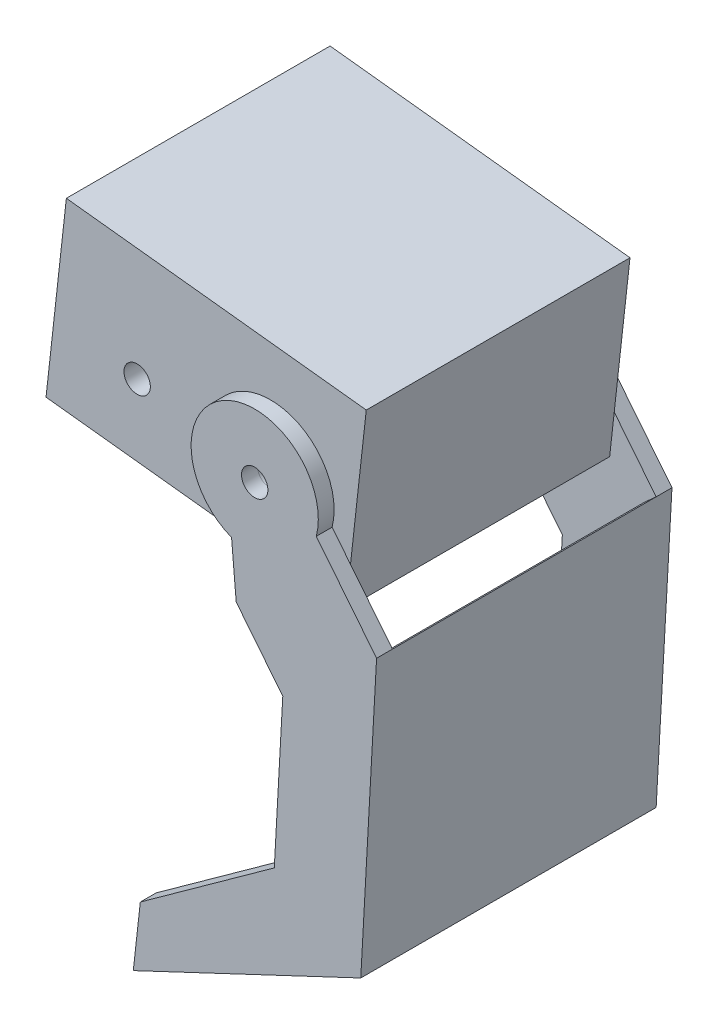
ISO-10303-21;
HEADER;
FILE_DESCRIPTION(('STEP AP214'),'2;1');
FILE_NAME('part.step','',(''),(''),'','','');
FILE_SCHEMA(('AUTOMOTIVE_DESIGN { 1 0 10303 214 1 1 1 1 }'));
ENDSEC;
DATA;
#1=APPLICATION_CONTEXT('core data for automotive mechanical design processes');
#2=APPLICATION_PROTOCOL_DEFINITION('international standard','automotive_design',2000,#1);
#3=PRODUCT_CONTEXT('',#1,'mechanical');
#4=PRODUCT('Part','Part','',(#3));
#5=PRODUCT_RELATED_PRODUCT_CATEGORY('part','',(#4));
#6=PRODUCT_DEFINITION_FORMATION('','',#4);
#7=PRODUCT_DEFINITION_CONTEXT('part definition',#1,'design');
#8=PRODUCT_DEFINITION('design','',#6,#7);
#9=PRODUCT_DEFINITION_SHAPE('','',#8);
#10=(LENGTH_UNIT() NAMED_UNIT(*) SI_UNIT(.MILLI.,.METRE.));
#11=(NAMED_UNIT(*) PLANE_ANGLE_UNIT() SI_UNIT($,.RADIAN.));
#12=(NAMED_UNIT(*) SI_UNIT($,.STERADIAN.) SOLID_ANGLE_UNIT());
#13=UNCERTAINTY_MEASURE_WITH_UNIT(LENGTH_MEASURE(1.E-05),#10,'distance_accuracy_value','');
#14=(GEOMETRIC_REPRESENTATION_CONTEXT(3) GLOBAL_UNCERTAINTY_ASSIGNED_CONTEXT((#13)) GLOBAL_UNIT_ASSIGNED_CONTEXT((#10,
#11,#12)) REPRESENTATION_CONTEXT('',''));
#15=CARTESIAN_POINT('',(0.,0.,0.));
#16=DIRECTION('',(0.,0.,1.));
#17=DIRECTION('',(1.,0.,0.));
#18=AXIS2_PLACEMENT_3D('',#15,#16,#17);
#19=CARTESIAN_POINT('',(-60.7140923076923,16.1163384615385,25.));
#20=DIRECTION('',(0.,0.,1.));
#21=DIRECTION('',(-0.993846153846154,0.110769230769231,0.));
#22=AXIS2_PLACEMENT_3D('',#19,#20,#21);
#23=PLANE('',#22);
#24=CARTESIAN_POINT('',(-60.7140923076923,16.1163384615385,25.));
#25=DIRECTION('',(0.,0.,-1.));
#26=DIRECTION('',(-0.993846153846154,0.110769230769231,0.));
#27=AXIS2_PLACEMENT_3D('',#24,#25,#26);
#28=CIRCLE('',#27,2.5);
#29=CARTESIAN_POINT('',(-63.1987076923077,16.3932615384615,25.));
#30=VERTEX_POINT('',#29);
#31=EDGE_CURVE('E282',#30,#30,#28,.T.);
#32=ORIENTED_EDGE('',*,*,#31,.F.);
#33=EDGE_LOOP('',(#32));
#34=FACE_BOUND('',#33,.T.);
#35=DIRECTION('',(0.110769230769231,0.993846153846154,0.));
#36=VECTOR('',#35,1.);
#37=CARTESIAN_POINT('',(-82.4001230769231,-63.6222153846154,25.));
#38=LINE('',#37,#36);
#39=CARTESIAN_POINT('',(-83.4691926581584,-73.214145238477,25.));
#40=VERTEX_POINT('',#39);
#41=CARTESIAN_POINT('',(-82.4001230769231,-63.6222153846154,25.));
#42=VERTEX_POINT('',#41);
#43=EDGE_CURVE('E187',#40,#42,#38,.T.);
#44=ORIENTED_EDGE('',*,*,#43,.T.);
#45=DIRECTION('',(0.811359006094352,0.584548170153313,0.));
#46=VECTOR('',#45,1.);
#47=CARTESIAN_POINT('',(-57.0007264957265,-45.3230769230769,25.));
#48=LINE('',#47,#46);
#49=CARTESIAN_POINT('',(-57.0007264957265,-45.3230769230769,25.));
#50=VERTEX_POINT('',#49);
#51=EDGE_CURVE('E321',#42,#50,#48,.T.);
#52=ORIENTED_EDGE('',*,*,#51,.T.);
#53=DIRECTION('',(0.0554700196225232,0.998460353205412,0.));
#54=VECTOR('',#53,1.);
#55=CARTESIAN_POINT('',(-55.3896153846154,-16.3230769230769,25.));
#56=LINE('',#55,#54);
#57=CARTESIAN_POINT('',(-55.3896153846154,-16.3230769230769,25.));
#58=VERTEX_POINT('',#57);
#59=EDGE_CURVE('E324',#50,#58,#56,.T.);
#60=ORIENTED_EDGE('',*,*,#59,.T.);
#61=DIRECTION('',(-0.624429680617044,0.781081029064525,0.));
#62=VECTOR('',#61,1.);
#63=CARTESIAN_POINT('',(-64.2203846153846,-5.27692307692307,25.));
#64=LINE('',#63,#62);
#65=CARTESIAN_POINT('',(-64.2203846153846,-5.27692307692307,25.));
#66=VERTEX_POINT('',#65);
#67=EDGE_CURVE('E327',#58,#66,#64,.T.);
#68=ORIENTED_EDGE('',*,*,#67,.T.);
#69=DIRECTION('',(-0.0862910994608008,0.996269966501975,0.));
#70=VECTOR('',#69,1.);
#71=CARTESIAN_POINT('',(-65.1003846153846,4.88307692307692,25.));
#72=LINE('',#71,#70);
#73=CARTESIAN_POINT('',(-65.1003846153846,4.88307692307692,25.));
#74=VERTEX_POINT('',#73);
#75=EDGE_CURVE('E330',#66,#74,#72,.T.);
#76=ORIENTED_EDGE('',*,*,#75,.T.);
#77=CARTESIAN_POINT('',(-60.7140923076923,16.1163384615385,25.));
#78=DIRECTION('',(0.,0.,-1.));
#79=DIRECTION('',(-0.993846153846154,0.110769230769231,0.));
#80=AXIS2_PLACEMENT_3D('',#77,#78,#79);
#81=CIRCLE('',#80,12.0592588909933);
#82=CARTESIAN_POINT('',(-49.037883863256,13.101063787139,25.));
#83=VERTEX_POINT('',#82);
#84=EDGE_CURVE('E293',#74,#83,#81,.T.);
#85=ORIENTED_EDGE('',*,*,#84,.T.);
#86=DIRECTION('',(0.624429680617043,-0.781081029064525,0.));
#87=VECTOR('',#86,1.);
#88=CARTESIAN_POINT('',(-37.605,-1.2,25.));
#89=LINE('',#88,#87);
#90=CARTESIAN_POINT('',(-37.605,-1.2,25.));
#91=VERTEX_POINT('',#90);
#92=EDGE_CURVE('E286',#83,#91,#89,.T.);
#93=ORIENTED_EDGE('',*,*,#92,.T.);
#94=DIRECTION('',(-0.7452413135251,-0.666794859469825,0.));
#95=VECTOR('',#94,1.);
#96=CARTESIAN_POINT('',(-37.605,-1.2,25.));
#97=LINE('',#96,#95);
#98=CARTESIAN_POINT('',(-39.7128607456559,-3.08598066716577,25.));
#99=VERTEX_POINT('',#98);
#100=EDGE_CURVE('E269',#91,#99,#97,.T.);
#101=ORIENTED_EDGE('',*,*,#100,.T.);
#102=DIRECTION('',(-0.0554700196225229,-0.998460353205412,0.));
#103=VECTOR('',#102,1.);
#104=CARTESIAN_POINT('',(-39.7128607456559,-3.08598066716577,25.));
#105=LINE('',#104,#103);
#106=CARTESIAN_POINT('',(-42.5358399960956,-53.8996071750799,25.));
#107=VERTEX_POINT('',#106);
#108=EDGE_CURVE('E272',#99,#107,#105,.T.);
#109=ORIENTED_EDGE('',*,*,#108,.T.);
#110=DIRECTION('',(-0.904377428015072,-0.426733485558425,0.));
#111=VECTOR('',#110,1.);
#112=CARTESIAN_POINT('',(-42.5358399960956,-53.8996071750799,25.));
#113=LINE('',#112,#111);
#114=EDGE_CURVE('E275',#107,#40,#113,.T.);
#115=ORIENTED_EDGE('',*,*,#114,.T.);
#116=EDGE_LOOP('',(#44,#52,#60,#68,#76,#85,#93,#101,#109,#115));
#117=FACE_BOUND('',#116,.T.);
#118=ADVANCED_FACE('F49',(#34,#117),#23,.F.);
#119=CARTESIAN_POINT('',(-60.7140923076923,16.1163384615385,-25.));
#120=DIRECTION('',(0.,0.,-1.));
#121=DIRECTION('',(-0.993846153846154,0.110769230769231,0.));
#122=AXIS2_PLACEMENT_3D('',#119,#120,#121);
#123=PLANE('',#122);
#124=CARTESIAN_POINT('',(-60.7140923076923,16.1163384615385,-25.));
#125=DIRECTION('',(0.,0.,-1.));
#126=DIRECTION('',(-0.993846153846154,0.110769230769231,0.));
#127=AXIS2_PLACEMENT_3D('',#124,#125,#126);
#128=CIRCLE('',#127,2.5);
#129=CARTESIAN_POINT('',(-63.1987076923077,16.3932615384615,-25.));
#130=VERTEX_POINT('',#129);
#131=EDGE_CURVE('E188',#130,#130,#128,.T.);
#132=ORIENTED_EDGE('',*,*,#131,.T.);
#133=EDGE_LOOP('',(#132));
#134=FACE_BOUND('',#133,.T.);
#135=DIRECTION('',(-0.904377428015072,-0.426733485558425,0.));
#136=VECTOR('',#135,1.);
#137=CARTESIAN_POINT('',(-42.5358399960956,-53.8996071750799,-25.));
#138=LINE('',#137,#136);
#139=CARTESIAN_POINT('',(-42.5358399960956,-53.8996071750799,-25.));
#140=VERTEX_POINT('',#139);
#141=CARTESIAN_POINT('',(-83.4691926581584,-73.214145238477,-25.));
#142=VERTEX_POINT('',#141);
#143=EDGE_CURVE('E194',#140,#142,#138,.T.);
#144=ORIENTED_EDGE('',*,*,#143,.F.);
#145=DIRECTION('',(-0.0554700196225229,-0.998460353205412,0.));
#146=VECTOR('',#145,1.);
#147=CARTESIAN_POINT('',(-39.7128607456559,-3.08598066716577,-25.));
#148=LINE('',#147,#146);
#149=CARTESIAN_POINT('',(-39.7128607456559,-3.08598066716577,-25.));
#150=VERTEX_POINT('',#149);
#151=EDGE_CURVE('E201',#150,#140,#148,.T.);
#152=ORIENTED_EDGE('',*,*,#151,.F.);
#153=DIRECTION('',(-0.7452413135251,-0.666794859469825,0.));
#154=VECTOR('',#153,1.);
#155=CARTESIAN_POINT('',(-37.605,-1.2,-25.));
#156=LINE('',#155,#154);
#157=CARTESIAN_POINT('',(-37.605,-1.2,-25.));
#158=VERTEX_POINT('',#157);
#159=EDGE_CURVE('E203',#158,#150,#156,.T.);
#160=ORIENTED_EDGE('',*,*,#159,.F.);
#161=DIRECTION('',(0.624429680617043,-0.781081029064525,0.));
#162=VECTOR('',#161,1.);
#163=CARTESIAN_POINT('',(-37.605,-1.2,-25.));
#164=LINE('',#163,#162);
#165=CARTESIAN_POINT('',(-49.037883863256,13.101063787139,-25.));
#166=VERTEX_POINT('',#165);
#167=EDGE_CURVE('E210',#166,#158,#164,.T.);
#168=ORIENTED_EDGE('',*,*,#167,.F.);
#169=CARTESIAN_POINT('',(-60.7140923076923,16.1163384615385,-25.));
#170=DIRECTION('',(0.,0.,-1.));
#171=DIRECTION('',(-0.993846153846154,0.110769230769231,0.));
#172=AXIS2_PLACEMENT_3D('',#169,#170,#171);
#173=CIRCLE('',#172,12.0592588909933);
#174=CARTESIAN_POINT('',(-65.1003846153846,4.88307692307692,-25.));
#175=VERTEX_POINT('',#174);
#176=EDGE_CURVE('E213',#175,#166,#173,.T.);
#177=ORIENTED_EDGE('',*,*,#176,.F.);
#178=DIRECTION('',(-0.0862910994608008,0.996269966501975,0.));
#179=VECTOR('',#178,1.);
#180=CARTESIAN_POINT('',(-65.1003846153846,4.88307692307692,-25.));
#181=LINE('',#180,#179);
#182=CARTESIAN_POINT('',(-64.2203846153846,-5.27692307692307,-25.));
#183=VERTEX_POINT('',#182);
#184=EDGE_CURVE('E216',#183,#175,#181,.T.);
#185=ORIENTED_EDGE('',*,*,#184,.F.);
#186=DIRECTION('',(-0.624429680617044,0.781081029064525,0.));
#187=VECTOR('',#186,1.);
#188=CARTESIAN_POINT('',(-64.2203846153846,-5.27692307692307,-25.));
#189=LINE('',#188,#187);
#190=CARTESIAN_POINT('',(-55.3896153846154,-16.3230769230769,-25.));
#191=VERTEX_POINT('',#190);
#192=EDGE_CURVE('E219',#191,#183,#189,.T.);
#193=ORIENTED_EDGE('',*,*,#192,.F.);
#194=DIRECTION('',(0.0554700196225232,0.998460353205412,0.));
#195=VECTOR('',#194,1.);
#196=CARTESIAN_POINT('',(-55.3896153846154,-16.3230769230769,-25.));
#197=LINE('',#196,#195);
#198=CARTESIAN_POINT('',(-57.0007264957265,-45.3230769230769,-25.));
#199=VERTEX_POINT('',#198);
#200=EDGE_CURVE('E222',#199,#191,#197,.T.);
#201=ORIENTED_EDGE('',*,*,#200,.F.);
#202=DIRECTION('',(0.811359006094352,0.584548170153313,0.));
#203=VECTOR('',#202,1.);
#204=CARTESIAN_POINT('',(-57.0007264957265,-45.3230769230769,-25.));
#205=LINE('',#204,#203);
#206=CARTESIAN_POINT('',(-82.4001230769231,-63.6222153846154,-25.));
#207=VERTEX_POINT('',#206);
#208=EDGE_CURVE('E197',#207,#199,#205,.T.);
#209=ORIENTED_EDGE('',*,*,#208,.F.);
#210=DIRECTION('',(0.110769230769231,0.993846153846154,0.));
#211=VECTOR('',#210,1.);
#212=CARTESIAN_POINT('',(-82.4001230769231,-63.6222153846154,-25.));
#213=LINE('',#212,#211);
#214=EDGE_CURVE('E184',#142,#207,#213,.T.);
#215=ORIENTED_EDGE('',*,*,#214,.F.);
#216=EDGE_LOOP('',(#144,#152,#160,#168,#177,#185,#193,#201,#209,#215));
#217=FACE_BOUND('',#216,.T.);
#218=ADVANCED_FACE('F192',(#134,#217),#123,.F.);
#219=CARTESIAN_POINT('',(-60.7140923076923,16.1163384615385,28.));
#220=DIRECTION('',(0.,0.,1.));
#221=DIRECTION('',(-0.993846153846154,0.110769230769231,0.));
#222=AXIS2_PLACEMENT_3D('',#219,#220,#221);
#223=PLANE('',#222);
#224=DIRECTION('',(0.624429680617044,-0.781081029064525,0.));
#225=VECTOR('',#224,1.);
#226=CARTESIAN_POINT('',(-45.5526923076923,8.74153846153846,28.));
#227=LINE('',#226,#225);
#228=CARTESIAN_POINT('',(-49.037883863256,13.101063787139,28.));
#229=VERTEX_POINT('',#228);
#230=CARTESIAN_POINT('',(-37.605,-1.2,28.));
#231=VERTEX_POINT('',#230);
#232=EDGE_CURVE('E289',#229,#231,#227,.T.);
#233=ORIENTED_EDGE('',*,*,#232,.F.);
#234=CARTESIAN_POINT('',(-60.7140923076923,16.1163384615385,28.));
#235=DIRECTION('',(0.,0.,-1.));
#236=DIRECTION('',(-0.993846153846154,0.110769230769231,0.));
#237=AXIS2_PLACEMENT_3D('',#234,#235,#236);
#238=CIRCLE('',#237,12.0592588909933);
#239=CARTESIAN_POINT('',(-65.1003846153846,4.88307692307692,28.));
#240=VERTEX_POINT('',#239);
#241=EDGE_CURVE('E314',#240,#229,#238,.T.);
#242=ORIENTED_EDGE('',*,*,#241,.F.);
#243=DIRECTION('',(-0.0862910994608008,0.996269966501975,0.));
#244=VECTOR('',#243,1.);
#245=CARTESIAN_POINT('',(-65.1003846153846,4.88307692307692,28.));
#246=LINE('',#245,#244);
#247=CARTESIAN_POINT('',(-64.2203846153846,-5.27692307692307,28.));
#248=VERTEX_POINT('',#247);
#249=EDGE_CURVE('E311',#248,#240,#246,.T.);
#250=ORIENTED_EDGE('',*,*,#249,.F.);
#251=DIRECTION('',(-0.624429680617044,0.781081029064525,0.));
#252=VECTOR('',#251,1.);
#253=CARTESIAN_POINT('',(-64.2203846153846,-5.27692307692307,28.));
#254=LINE('',#253,#252);
#255=CARTESIAN_POINT('',(-55.3896153846154,-16.3230769230769,28.));
#256=VERTEX_POINT('',#255);
#257=EDGE_CURVE('E308',#256,#248,#254,.T.);
#258=ORIENTED_EDGE('',*,*,#257,.F.);
#259=DIRECTION('',(0.0554700196225232,0.998460353205412,0.));
#260=VECTOR('',#259,1.);
#261=CARTESIAN_POINT('',(-55.3896153846154,-16.3230769230769,28.));
#262=LINE('',#261,#260);
#263=CARTESIAN_POINT('',(-57.0007264957265,-45.3230769230769,28.));
#264=VERTEX_POINT('',#263);
#265=EDGE_CURVE('E305',#264,#256,#262,.T.);
#266=ORIENTED_EDGE('',*,*,#265,.F.);
#267=DIRECTION('',(0.811359006094352,0.584548170153313,0.));
#268=VECTOR('',#267,1.);
#269=CARTESIAN_POINT('',(-57.0007264957265,-45.3230769230769,28.));
#270=LINE('',#269,#268);
#271=CARTESIAN_POINT('',(-82.4001230769231,-63.6222153846154,28.));
#272=VERTEX_POINT('',#271);
#273=EDGE_CURVE('E302',#272,#264,#270,.T.);
#274=ORIENTED_EDGE('',*,*,#273,.F.);
#275=DIRECTION('',(0.110769230769231,0.993846153846154,0.));
#276=VECTOR('',#275,1.);
#277=CARTESIAN_POINT('',(-82.4001230769231,-63.6222153846154,28.));
#278=LINE('',#277,#276);
#279=CARTESIAN_POINT('',(-83.7293538461538,-75.5483692307692,28.));
#280=VERTEX_POINT('',#279);
#281=EDGE_CURVE('E299',#280,#272,#278,.T.);
#282=ORIENTED_EDGE('',*,*,#281,.F.);
#283=DIRECTION('',(-0.904377428015072,-0.426733485558425,0.));
#284=VECTOR('',#283,1.);
#285=CARTESIAN_POINT('',(-83.7293538461538,-75.5483692307692,28.));
#286=LINE('',#285,#284);
#287=CARTESIAN_POINT('',(-40.605,-55.2,28.));
#288=VERTEX_POINT('',#287);
#289=EDGE_CURVE('E296',#288,#280,#286,.T.);
#290=ORIENTED_EDGE('',*,*,#289,.F.);
#291=DIRECTION('',(-0.055470019622523,-0.998460353205412,0.));
#292=VECTOR('',#291,1.);
#293=CARTESIAN_POINT('',(-40.605,-55.2,28.));
#294=LINE('',#293,#292);
#295=EDGE_CURVE('E292',#231,#288,#294,.T.);
#296=ORIENTED_EDGE('',*,*,#295,.F.);
#297=EDGE_LOOP('',(#233,#242,#250,#258,#266,#274,#282,#290,#296));
#298=FACE_BOUND('',#297,.T.);
#299=CARTESIAN_POINT('',(-60.7140923076923,16.1163384615385,28.));
#300=DIRECTION('',(0.,0.,-1.));
#301=DIRECTION('',(-0.993846153846154,0.110769230769231,0.));
#302=AXIS2_PLACEMENT_3D('',#299,#300,#301);
#303=CIRCLE('',#302,2.5);
#304=CARTESIAN_POINT('',(-63.1987076923077,16.3932615384615,28.));
#305=VERTEX_POINT('',#304);
#306=EDGE_CURVE('E283',#305,#305,#303,.T.);
#307=ORIENTED_EDGE('',*,*,#306,.T.);
#308=EDGE_LOOP('',(#307));
#309=FACE_BOUND('',#308,.T.);
#310=ADVANCED_FACE('F381',(#298,#309),#223,.T.);
#311=CARTESIAN_POINT('',(-37.605,-1.2,28.));
#312=DIRECTION('',(-0.781081029064525,-0.624429680617044,0.));
#313=DIRECTION('',(-0.624429680617044,0.781081029064525,0.));
#314=AXIS2_PLACEMENT_3D('',#311,#312,#313);
#315=PLANE('',#314);
#316=ORIENTED_EDGE('',*,*,#92,.F.);
#317=DIRECTION('',(0.,0.,-1.));
#318=VECTOR('',#317,1.);
#319=CARTESIAN_POINT('',(-49.037883863256,13.101063787139,28.));
#320=LINE('',#319,#318);
#321=EDGE_CURVE('E317',#229,#83,#320,.T.);
#322=ORIENTED_EDGE('',*,*,#321,.F.);
#323=ORIENTED_EDGE('',*,*,#232,.T.);
#324=DIRECTION('',(0.,0.,-1.));
#325=VECTOR('',#324,1.);
#326=CARTESIAN_POINT('',(-37.605,-1.2,28.));
#327=LINE('',#326,#325);
#328=EDGE_CURVE('E12',#231,#91,#327,.T.);
#329=ORIENTED_EDGE('',*,*,#328,.T.);
#330=EDGE_LOOP('',(#316,#322,#323,#329));
#331=FACE_BOUND('',#330,.T.);
#332=ADVANCED_FACE('F51',(#331),#315,.F.);
#333=CARTESIAN_POINT('',(-40.605,-55.2,28.));
#334=DIRECTION('',(-0.998460353205412,0.0554700196225229,0.));
#335=DIRECTION('',(0.055470019622523,0.998460353205413,0.));
#336=AXIS2_PLACEMENT_3D('',#333,#334,#335);
#337=PLANE('',#336);
#338=ORIENTED_EDGE('',*,*,#328,.F.);
#339=ORIENTED_EDGE('',*,*,#295,.T.);
#340=DIRECTION('',(0.,0.,-1.));
#341=VECTOR('',#340,1.);
#342=CARTESIAN_POINT('',(-40.605,-55.2,28.));
#343=LINE('',#342,#341);
#344=CARTESIAN_POINT('',(-40.605,-55.2,-28.));
#345=VERTEX_POINT('',#344);
#346=EDGE_CURVE('E57',#288,#345,#343,.T.);
#347=ORIENTED_EDGE('',*,*,#346,.T.);
#348=DIRECTION('',(-0.055470019622523,-0.998460353205412,0.));
#349=VECTOR('',#348,1.);
#350=CARTESIAN_POINT('',(-40.605,-55.2,-28.));
#351=LINE('',#350,#349);
#352=CARTESIAN_POINT('',(-37.605,-1.2,-28.));
#353=VERTEX_POINT('',#352);
#354=EDGE_CURVE('E227',#353,#345,#351,.T.);
#355=ORIENTED_EDGE('',*,*,#354,.F.);
#356=DIRECTION('',(0.,0.,1.));
#357=VECTOR('',#356,1.);
#358=CARTESIAN_POINT('',(-37.605,-1.2,-28.));
#359=LINE('',#358,#357);
#360=EDGE_CURVE('E254',#353,#158,#359,.T.);
#361=ORIENTED_EDGE('',*,*,#360,.T.);
#362=DIRECTION('',(0.,0.,1.));
#363=VECTOR('',#362,1.);
#364=CARTESIAN_POINT('',(-37.605,-1.2,-71.9292288820542));
#365=LINE('',#364,#363);
#366=EDGE_CURVE('E280',#158,#91,#365,.T.);
#367=ORIENTED_EDGE('',*,*,#366,.T.);
#368=EDGE_LOOP('',(#338,#339,#347,#355,#361,#367));
#369=FACE_BOUND('',#368,.T.);
#370=ADVANCED_FACE('F351',(#369),#337,.F.);
#371=CARTESIAN_POINT('',(-83.7293538461538,-75.5483692307692,28.));
#372=DIRECTION('',(-0.426733485558425,0.904377428015072,0.));
#373=DIRECTION('',(0.904377428015072,0.426733485558425,0.));
#374=AXIS2_PLACEMENT_3D('',#371,#372,#373);
#375=PLANE('',#374);
#376=DIRECTION('',(-0.904377428015072,-0.426733485558425,0.));
#377=VECTOR('',#376,1.);
#378=CARTESIAN_POINT('',(-83.7293538461538,-75.5483692307692,-28.));
#379=LINE('',#378,#377);
#380=CARTESIAN_POINT('',(-83.7293538461538,-75.5483692307692,-28.));
#381=VERTEX_POINT('',#380);
#382=EDGE_CURVE('E230',#345,#381,#379,.T.);
#383=ORIENTED_EDGE('',*,*,#382,.F.);
#384=ORIENTED_EDGE('',*,*,#346,.F.);
#385=ORIENTED_EDGE('',*,*,#289,.T.);
#386=DIRECTION('',(0.,0.,-1.));
#387=VECTOR('',#386,1.);
#388=CARTESIAN_POINT('',(-83.7293538461538,-75.5483692307692,28.));
#389=LINE('',#388,#387);
#390=EDGE_CURVE('E346',#280,#381,#389,.T.);
#391=ORIENTED_EDGE('',*,*,#390,.T.);
#392=EDGE_LOOP('',(#383,#384,#385,#391));
#393=FACE_BOUND('',#392,.T.);
#394=ADVANCED_FACE('F355',(#393),#375,.F.);
#395=CARTESIAN_POINT('',(-82.4001230769231,-63.6222153846154,28.));
#396=DIRECTION('',(0.993846153846154,-0.110769230769231,0.));
#397=DIRECTION('',(0.,0.,1.));
#398=AXIS2_PLACEMENT_3D('',#395,#396,#397);
#399=PLANE('',#398);
#400=ORIENTED_EDGE('',*,*,#390,.F.);
#401=ORIENTED_EDGE('',*,*,#281,.T.);
#402=DIRECTION('',(0.,0.,-1.));
#403=VECTOR('',#402,1.);
#404=CARTESIAN_POINT('',(-82.4001230769231,-63.6222153846154,28.));
#405=LINE('',#404,#403);
#406=EDGE_CURVE('E344',#272,#42,#405,.T.);
#407=ORIENTED_EDGE('',*,*,#406,.T.);
#408=ORIENTED_EDGE('',*,*,#43,.F.);
#409=DIRECTION('',(0.,0.,1.));
#410=VECTOR('',#409,1.);
#411=CARTESIAN_POINT('',(-83.4691926581584,-73.214145238477,-47.0064689993535));
#412=LINE('',#411,#410);
#413=EDGE_CURVE('E64',#142,#40,#412,.T.);
#414=ORIENTED_EDGE('',*,*,#413,.F.);
#415=ORIENTED_EDGE('',*,*,#214,.T.);
#416=DIRECTION('',(0.,0.,1.));
#417=VECTOR('',#416,1.);
#418=CARTESIAN_POINT('',(-82.4001230769231,-63.6222153846154,-28.));
#419=LINE('',#418,#417);
#420=CARTESIAN_POINT('',(-82.4001230769231,-63.6222153846154,-28.));
#421=VERTEX_POINT('',#420);
#422=EDGE_CURVE('E259',#421,#207,#419,.T.);
#423=ORIENTED_EDGE('',*,*,#422,.F.);
#424=DIRECTION('',(0.110769230769231,0.993846153846154,0.));
#425=VECTOR('',#424,1.);
#426=CARTESIAN_POINT('',(-82.4001230769231,-63.6222153846154,-28.));
#427=LINE('',#426,#425);
#428=EDGE_CURVE('E233',#381,#421,#427,.T.);
#429=ORIENTED_EDGE('',*,*,#428,.F.);
#430=EDGE_LOOP('',(#400,#401,#407,#408,#414,#415,#423,#429));
#431=FACE_BOUND('',#430,.T.);
#432=ADVANCED_FACE('F182',(#431),#399,.F.);
#433=CARTESIAN_POINT('',(-57.0007264957265,-45.3230769230769,28.));
#434=DIRECTION('',(0.584548170153313,-0.811359006094352,0.));
#435=DIRECTION('',(-0.811359006094352,-0.584548170153313,0.));
#436=AXIS2_PLACEMENT_3D('',#433,#434,#435);
#437=PLANE('',#436);
#438=ORIENTED_EDGE('',*,*,#51,.F.);
#439=ORIENTED_EDGE('',*,*,#406,.F.);
#440=ORIENTED_EDGE('',*,*,#273,.T.);
#441=DIRECTION('',(0.,0.,-1.));
#442=VECTOR('',#441,1.);
#443=CARTESIAN_POINT('',(-57.0007264957265,-45.3230769230769,28.));
#444=LINE('',#443,#442);
#445=EDGE_CURVE('E342',#264,#50,#444,.T.);
#446=ORIENTED_EDGE('',*,*,#445,.T.);
#447=EDGE_LOOP('',(#438,#439,#440,#446));
#448=FACE_BOUND('',#447,.T.);
#449=ADVANCED_FACE('F405',(#448),#437,.F.);
#450=CARTESIAN_POINT('',(-55.3896153846154,-16.3230769230769,28.));
#451=DIRECTION('',(0.998460353205412,-0.0554700196225231,0.));
#452=DIRECTION('',(-0.0554700196225232,-0.998460353205413,0.));
#453=AXIS2_PLACEMENT_3D('',#450,#451,#452);
#454=PLANE('',#453);
#455=ORIENTED_EDGE('',*,*,#59,.F.);
#456=ORIENTED_EDGE('',*,*,#445,.F.);
#457=ORIENTED_EDGE('',*,*,#265,.T.);
#458=DIRECTION('',(0.,0.,-1.));
#459=VECTOR('',#458,1.);
#460=CARTESIAN_POINT('',(-55.3896153846154,-16.3230769230769,28.));
#461=LINE('',#460,#459);
#462=EDGE_CURVE('E340',#256,#58,#461,.T.);
#463=ORIENTED_EDGE('',*,*,#462,.T.);
#464=EDGE_LOOP('',(#455,#456,#457,#463));
#465=FACE_BOUND('',#464,.T.);
#466=ADVANCED_FACE('F407',(#465),#454,.F.);
#467=CARTESIAN_POINT('',(-64.2203846153846,-5.27692307692307,28.));
#468=DIRECTION('',(0.781081029064525,0.624429680617043,0.));
#469=DIRECTION('',(0.624429680617044,-0.781081029064525,0.));
#470=AXIS2_PLACEMENT_3D('',#467,#468,#469);
#471=PLANE('',#470);
#472=ORIENTED_EDGE('',*,*,#67,.F.);
#473=ORIENTED_EDGE('',*,*,#462,.F.);
#474=ORIENTED_EDGE('',*,*,#257,.T.);
#475=DIRECTION('',(0.,0.,-1.));
#476=VECTOR('',#475,1.);
#477=CARTESIAN_POINT('',(-64.2203846153846,-5.27692307692307,28.));
#478=LINE('',#477,#476);
#479=EDGE_CURVE('E338',#248,#66,#478,.T.);
#480=ORIENTED_EDGE('',*,*,#479,.T.);
#481=EDGE_LOOP('',(#472,#473,#474,#480));
#482=FACE_BOUND('',#481,.T.);
#483=ADVANCED_FACE('F411',(#482),#471,.F.);
#484=CARTESIAN_POINT('',(-65.1003846153846,4.88307692307692,28.));
#485=DIRECTION('',(0.996269966501975,0.0862910994608008,0.));
#486=DIRECTION('',(0.0862910994608008,-0.996269966501975,0.));
#487=AXIS2_PLACEMENT_3D('',#484,#485,#486);
#488=PLANE('',#487);
#489=ORIENTED_EDGE('',*,*,#75,.F.);
#490=ORIENTED_EDGE('',*,*,#479,.F.);
#491=ORIENTED_EDGE('',*,*,#249,.T.);
#492=DIRECTION('',(0.,0.,-1.));
#493=VECTOR('',#492,1.);
#494=CARTESIAN_POINT('',(-65.1003846153846,4.88307692307692,28.));
#495=LINE('',#494,#493);
#496=EDGE_CURVE('E336',#240,#74,#495,.T.);
#497=ORIENTED_EDGE('',*,*,#496,.T.);
#498=EDGE_LOOP('',(#489,#490,#491,#497));
#499=FACE_BOUND('',#498,.T.);
#500=ADVANCED_FACE('F413',(#499),#488,.F.);
#501=CARTESIAN_POINT('',(-60.7140923076923,16.1163384615385,28.));
#502=DIRECTION('',(0.,0.,-1.));
#503=DIRECTION('',(0.993846153846154,-0.110769230769231,0.));
#504=AXIS2_PLACEMENT_3D('',#501,#502,#503);
#505=CYLINDRICAL_SURFACE('',#504,12.0592588909933);
#506=ORIENTED_EDGE('',*,*,#84,.F.);
#507=ORIENTED_EDGE('',*,*,#496,.F.);
#508=ORIENTED_EDGE('',*,*,#241,.T.);
#509=ORIENTED_EDGE('',*,*,#321,.T.);
#510=EDGE_LOOP('',(#506,#507,#508,#509));
#511=FACE_BOUND('',#510,.T.);
#512=ADVANCED_FACE('F377',(#511),#505,.T.);
#513=CARTESIAN_POINT('',(-60.7140923076923,16.1163384615385,28.));
#514=DIRECTION('',(0.,0.,-1.));
#515=DIRECTION('',(0.993846153846154,-0.110769230769231,0.));
#516=AXIS2_PLACEMENT_3D('',#513,#514,#515);
#517=CYLINDRICAL_SURFACE('',#516,2.5);
#518=ORIENTED_EDGE('',*,*,#306,.F.);
#519=EDGE_LOOP('',(#518));
#520=FACE_BOUND('',#519,.T.);
#521=ORIENTED_EDGE('',*,*,#31,.T.);
#522=EDGE_LOOP('',(#521));
#523=FACE_BOUND('',#522,.T.);
#524=ADVANCED_FACE('F420',(#520,#523),#517,.F.);
#525=CARTESIAN_POINT('',(-42.5358399960956,-53.8996071750799,-71.9292288820542));
#526=DIRECTION('',(0.426733485558425,-0.904377428015072,0.));
#527=DIRECTION('',(-0.904377428015073,-0.426733485558425,0.));
#528=AXIS2_PLACEMENT_3D('',#525,#526,#527);
#529=PLANE('',#528);
#530=ORIENTED_EDGE('',*,*,#114,.F.);
#531=DIRECTION('',(0.,0.,1.));
#532=VECTOR('',#531,1.);
#533=CARTESIAN_POINT('',(-42.5358399960956,-53.8996071750799,-71.9292288820542));
#534=LINE('',#533,#532);
#535=EDGE_CURVE('E72',#140,#107,#534,.T.);
#536=ORIENTED_EDGE('',*,*,#535,.F.);
#537=ORIENTED_EDGE('',*,*,#143,.T.);
#538=ORIENTED_EDGE('',*,*,#413,.T.);
#539=EDGE_LOOP('',(#530,#536,#537,#538));
#540=FACE_BOUND('',#539,.T.);
#541=ADVANCED_FACE('F200',(#540),#529,.F.);
#542=CARTESIAN_POINT('',(-39.7128607456559,-3.08598066716577,-71.9292288820542));
#543=DIRECTION('',(0.998460353205412,-0.0554700196225228,0.));
#544=DIRECTION('',(-0.0554700196225229,-0.998460353205413,0.));
#545=AXIS2_PLACEMENT_3D('',#542,#543,#544);
#546=PLANE('',#545);
#547=ORIENTED_EDGE('',*,*,#535,.T.);
#548=ORIENTED_EDGE('',*,*,#108,.F.);
#549=DIRECTION('',(0.,0.,1.));
#550=VECTOR('',#549,1.);
#551=CARTESIAN_POINT('',(-39.7128607456559,-3.08598066716577,-71.9292288820542));
#552=LINE('',#551,#550);
#553=EDGE_CURVE('E278',#150,#99,#552,.T.);
#554=ORIENTED_EDGE('',*,*,#553,.F.);
#555=ORIENTED_EDGE('',*,*,#151,.T.);
#556=EDGE_LOOP('',(#547,#548,#554,#555));
#557=FACE_BOUND('',#556,.T.);
#558=ADVANCED_FACE('F402',(#557),#546,.F.);
#559=CARTESIAN_POINT('',(-37.605,-1.2,-71.9292288820542));
#560=DIRECTION('',(0.666794859469825,-0.7452413135251,0.));
#561=DIRECTION('',(-0.7452413135251,-0.666794859469825,0.));
#562=AXIS2_PLACEMENT_3D('',#559,#560,#561);
#563=PLANE('',#562);
#564=ORIENTED_EDGE('',*,*,#553,.T.);
#565=ORIENTED_EDGE('',*,*,#100,.F.);
#566=ORIENTED_EDGE('',*,*,#366,.F.);
#567=ORIENTED_EDGE('',*,*,#159,.T.);
#568=EDGE_LOOP('',(#564,#565,#566,#567));
#569=FACE_BOUND('',#568,.T.);
#570=ADVANCED_FACE('F372',(#569),#563,.F.);
#571=CARTESIAN_POINT('',(-60.7140923076923,16.1163384615385,-28.));
#572=DIRECTION('',(0.,0.,-1.));
#573=DIRECTION('',(-0.993846153846154,0.110769230769231,0.));
#574=AXIS2_PLACEMENT_3D('',#571,#572,#573);
#575=PLANE('',#574);
#576=DIRECTION('',(0.624429680617044,-0.781081029064525,0.));
#577=VECTOR('',#576,1.);
#578=CARTESIAN_POINT('',(-45.5526923076923,8.74153846153846,-28.));
#579=LINE('',#578,#577);
#580=CARTESIAN_POINT('',(-49.037883863256,13.101063787139,-28.));
#581=VERTEX_POINT('',#580);
#582=EDGE_CURVE('E198',#581,#353,#579,.T.);
#583=ORIENTED_EDGE('',*,*,#582,.T.);
#584=ORIENTED_EDGE('',*,*,#354,.T.);
#585=ORIENTED_EDGE('',*,*,#382,.T.);
#586=ORIENTED_EDGE('',*,*,#428,.T.);
#587=DIRECTION('',(0.811359006094352,0.584548170153313,0.));
#588=VECTOR('',#587,1.);
#589=CARTESIAN_POINT('',(-57.0007264957265,-45.3230769230769,-28.));
#590=LINE('',#589,#588);
#591=CARTESIAN_POINT('',(-57.0007264957265,-45.3230769230769,-28.));
#592=VERTEX_POINT('',#591);
#593=EDGE_CURVE('E236',#421,#592,#590,.T.);
#594=ORIENTED_EDGE('',*,*,#593,.T.);
#595=DIRECTION('',(0.0554700196225232,0.998460353205412,0.));
#596=VECTOR('',#595,1.);
#597=CARTESIAN_POINT('',(-55.3896153846154,-16.3230769230769,-28.));
#598=LINE('',#597,#596);
#599=CARTESIAN_POINT('',(-55.3896153846154,-16.3230769230769,-28.));
#600=VERTEX_POINT('',#599);
#601=EDGE_CURVE('E239',#592,#600,#598,.T.);
#602=ORIENTED_EDGE('',*,*,#601,.T.);
#603=DIRECTION('',(-0.624429680617044,0.781081029064525,0.));
#604=VECTOR('',#603,1.);
#605=CARTESIAN_POINT('',(-64.2203846153846,-5.27692307692307,-28.));
#606=LINE('',#605,#604);
#607=CARTESIAN_POINT('',(-64.2203846153846,-5.27692307692307,-28.));
#608=VERTEX_POINT('',#607);
#609=EDGE_CURVE('E242',#600,#608,#606,.T.);
#610=ORIENTED_EDGE('',*,*,#609,.T.);
#611=DIRECTION('',(-0.0862910994608008,0.996269966501975,0.));
#612=VECTOR('',#611,1.);
#613=CARTESIAN_POINT('',(-65.1003846153846,4.88307692307692,-28.));
#614=LINE('',#613,#612);
#615=CARTESIAN_POINT('',(-65.1003846153846,4.88307692307692,-28.));
#616=VERTEX_POINT('',#615);
#617=EDGE_CURVE('E245',#608,#616,#614,.T.);
#618=ORIENTED_EDGE('',*,*,#617,.T.);
#619=CARTESIAN_POINT('',(-60.7140923076923,16.1163384615385,-28.));
#620=DIRECTION('',(0.,0.,-1.));
#621=DIRECTION('',(-0.993846153846154,0.110769230769231,0.));
#622=AXIS2_PLACEMENT_3D('',#619,#620,#621);
#623=CIRCLE('',#622,12.0592588909933);
#624=EDGE_CURVE('E248',#616,#581,#623,.T.);
#625=ORIENTED_EDGE('',*,*,#624,.T.);
#626=EDGE_LOOP('',(#583,#584,#585,#586,#594,#602,#610,#618,#625));
#627=FACE_BOUND('',#626,.T.);
#628=CARTESIAN_POINT('',(-60.7140923076923,16.1163384615385,-28.));
#629=DIRECTION('',(0.,0.,-1.));
#630=DIRECTION('',(-0.993846153846154,0.110769230769231,0.));
#631=AXIS2_PLACEMENT_3D('',#628,#629,#630);
#632=CIRCLE('',#631,2.5);
#633=CARTESIAN_POINT('',(-63.1987076923077,16.3932615384615,-28.));
#634=VERTEX_POINT('',#633);
#635=EDGE_CURVE('E251',#634,#634,#632,.T.);
#636=ORIENTED_EDGE('',*,*,#635,.F.);
#637=EDGE_LOOP('',(#636));
#638=FACE_BOUND('',#637,.T.);
#639=ADVANCED_FACE('F358',(#627,#638),#575,.T.);
#640=CARTESIAN_POINT('',(-37.605,-1.2,-28.));
#641=DIRECTION('',(-0.781081029064525,-0.624429680617044,0.));
#642=DIRECTION('',(-0.624429680617044,0.781081029064525,0.));
#643=AXIS2_PLACEMENT_3D('',#640,#641,#642);
#644=PLANE('',#643);
#645=ORIENTED_EDGE('',*,*,#167,.T.);
#646=ORIENTED_EDGE('',*,*,#360,.F.);
#647=ORIENTED_EDGE('',*,*,#582,.F.);
#648=DIRECTION('',(0.,0.,1.));
#649=VECTOR('',#648,1.);
#650=CARTESIAN_POINT('',(-49.037883863256,13.101063787139,-28.));
#651=LINE('',#650,#649);
#652=EDGE_CURVE('E257',#581,#166,#651,.T.);
#653=ORIENTED_EDGE('',*,*,#652,.T.);
#654=EDGE_LOOP('',(#645,#646,#647,#653));
#655=FACE_BOUND('',#654,.T.);
#656=ADVANCED_FACE('F364',(#655),#644,.F.);
#657=CARTESIAN_POINT('',(-57.0007264957265,-45.3230769230769,-28.));
#658=DIRECTION('',(0.584548170153313,-0.811359006094352,0.));
#659=DIRECTION('',(-0.811359006094352,-0.584548170153313,0.));
#660=AXIS2_PLACEMENT_3D('',#657,#658,#659);
#661=PLANE('',#660);
#662=ORIENTED_EDGE('',*,*,#208,.T.);
#663=DIRECTION('',(0.,0.,1.));
#664=VECTOR('',#663,1.);
#665=CARTESIAN_POINT('',(-57.0007264957265,-45.3230769230769,-28.));
#666=LINE('',#665,#664);
#667=EDGE_CURVE('E261',#592,#199,#666,.T.);
#668=ORIENTED_EDGE('',*,*,#667,.F.);
#669=ORIENTED_EDGE('',*,*,#593,.F.);
#670=ORIENTED_EDGE('',*,*,#422,.T.);
#671=EDGE_LOOP('',(#662,#668,#669,#670));
#672=FACE_BOUND('',#671,.T.);
#673=ADVANCED_FACE('F388',(#672),#661,.F.);
#674=CARTESIAN_POINT('',(-55.3896153846154,-16.3230769230769,-28.));
#675=DIRECTION('',(0.998460353205412,-0.0554700196225231,0.));
#676=DIRECTION('',(-0.0554700196225232,-0.998460353205413,0.));
#677=AXIS2_PLACEMENT_3D('',#674,#675,#676);
#678=PLANE('',#677);
#679=ORIENTED_EDGE('',*,*,#200,.T.);
#680=DIRECTION('',(0.,0.,1.));
#681=VECTOR('',#680,1.);
#682=CARTESIAN_POINT('',(-55.3896153846154,-16.3230769230769,-28.));
#683=LINE('',#682,#681);
#684=EDGE_CURVE('E263',#600,#191,#683,.T.);
#685=ORIENTED_EDGE('',*,*,#684,.F.);
#686=ORIENTED_EDGE('',*,*,#601,.F.);
#687=ORIENTED_EDGE('',*,*,#667,.T.);
#688=EDGE_LOOP('',(#679,#685,#686,#687));
#689=FACE_BOUND('',#688,.T.);
#690=ADVANCED_FACE('F390',(#689),#678,.F.);
#691=CARTESIAN_POINT('',(-64.2203846153846,-5.27692307692307,-28.));
#692=DIRECTION('',(0.781081029064525,0.624429680617043,0.));
#693=DIRECTION('',(0.624429680617044,-0.781081029064525,0.));
#694=AXIS2_PLACEMENT_3D('',#691,#692,#693);
#695=PLANE('',#694);
#696=ORIENTED_EDGE('',*,*,#192,.T.);
#697=DIRECTION('',(0.,0.,1.));
#698=VECTOR('',#697,1.);
#699=CARTESIAN_POINT('',(-64.2203846153846,-5.27692307692307,-28.));
#700=LINE('',#699,#698);
#701=EDGE_CURVE('E265',#608,#183,#700,.T.);
#702=ORIENTED_EDGE('',*,*,#701,.F.);
#703=ORIENTED_EDGE('',*,*,#609,.F.);
#704=ORIENTED_EDGE('',*,*,#684,.T.);
#705=EDGE_LOOP('',(#696,#702,#703,#704));
#706=FACE_BOUND('',#705,.T.);
#707=ADVANCED_FACE('F394',(#706),#695,.F.);
#708=CARTESIAN_POINT('',(-65.1003846153846,4.88307692307692,-28.));
#709=DIRECTION('',(0.996269966501975,0.0862910994608008,0.));
#710=DIRECTION('',(0.0862910994608008,-0.996269966501975,0.));
#711=AXIS2_PLACEMENT_3D('',#708,#709,#710);
#712=PLANE('',#711);
#713=ORIENTED_EDGE('',*,*,#184,.T.);
#714=DIRECTION('',(0.,0.,1.));
#715=VECTOR('',#714,1.);
#716=CARTESIAN_POINT('',(-65.1003846153846,4.88307692307692,-28.));
#717=LINE('',#716,#715);
#718=EDGE_CURVE('E267',#616,#175,#717,.T.);
#719=ORIENTED_EDGE('',*,*,#718,.F.);
#720=ORIENTED_EDGE('',*,*,#617,.F.);
#721=ORIENTED_EDGE('',*,*,#701,.T.);
#722=EDGE_LOOP('',(#713,#719,#720,#721));
#723=FACE_BOUND('',#722,.T.);
#724=ADVANCED_FACE('F397',(#723),#712,.F.);
#725=CARTESIAN_POINT('',(-60.7140923076923,16.1163384615385,-28.));
#726=DIRECTION('',(0.,0.,1.));
#727=DIRECTION('',(0.993846153846154,-0.110769230769231,0.));
#728=AXIS2_PLACEMENT_3D('',#725,#726,#727);
#729=CYLINDRICAL_SURFACE('',#728,12.0592588909933);
#730=ORIENTED_EDGE('',*,*,#176,.T.);
#731=ORIENTED_EDGE('',*,*,#652,.F.);
#732=ORIENTED_EDGE('',*,*,#624,.F.);
#733=ORIENTED_EDGE('',*,*,#718,.T.);
#734=EDGE_LOOP('',(#730,#731,#732,#733));
#735=FACE_BOUND('',#734,.T.);
#736=ADVANCED_FACE('F401',(#735),#729,.T.);
#737=CARTESIAN_POINT('',(-60.7140923076923,16.1163384615385,-28.));
#738=DIRECTION('',(0.,0.,1.));
#739=DIRECTION('',(0.993846153846154,-0.110769230769231,0.));
#740=AXIS2_PLACEMENT_3D('',#737,#738,#739);
#741=CYLINDRICAL_SURFACE('',#740,2.5);
#742=ORIENTED_EDGE('',*,*,#635,.T.);
#743=EDGE_LOOP('',(#742));
#744=FACE_BOUND('',#743,.T.);
#745=ORIENTED_EDGE('',*,*,#131,.F.);
#746=EDGE_LOOP('',(#745));
#747=FACE_BOUND('',#746,.T.);
#748=ADVANCED_FACE('F444',(#744,#747),#741,.F.);
#749=CLOSED_SHELL('',(#118,#218,#310,#332,#370,#394,#432,#449,#466,#483,#500,#512,#524,#541,
#558,#570,#639,#656,#673,#690,#707,#724,#736,#748));
#750=MANIFOLD_SOLID_BREP('B2',#749);
#751=CARTESIAN_POINT('',(-99.4198615384615,41.9124923076923,25.));
#752=DIRECTION('',(0.993846153846154,-0.110769230769231,0.));
#753=DIRECTION('',(0.,0.,1.));
#754=AXIS2_PLACEMENT_3D('',#751,#752,#753);
#755=PLANE('',#754);
#756=DIRECTION('',(0.,0.,-1.));
#757=VECTOR('',#756,1.);
#758=CARTESIAN_POINT('',(-103.274630769231,7.32664615384616,25.));
#759=LINE('',#758,#757);
#760=CARTESIAN_POINT('',(-103.274630769231,7.32664615384616,25.));
#761=VERTEX_POINT('',#760);
#762=CARTESIAN_POINT('',(-103.274630769231,7.32664615384616,-25.));
#763=VERTEX_POINT('',#762);
#764=EDGE_CURVE('E707',#761,#763,#759,.T.);
#765=ORIENTED_EDGE('',*,*,#764,.F.);
#766=DIRECTION('',(-0.110769230769231,-0.993846153846154,0.));
#767=VECTOR('',#766,1.);
#768=CARTESIAN_POINT('',(-99.4198615384615,41.9124923076923,25.));
#769=LINE('',#768,#767);
#770=CARTESIAN_POINT('',(-99.4198615384615,41.9124923076923,25.));
#771=VERTEX_POINT('',#770);
#772=EDGE_CURVE('E706',#771,#761,#769,.T.);
#773=ORIENTED_EDGE('',*,*,#772,.F.);
#774=DIRECTION('',(0.,0.,-1.));
#775=VECTOR('',#774,1.);
#776=CARTESIAN_POINT('',(-99.4198615384615,41.9124923076923,25.));
#777=LINE('',#776,#775);
#778=CARTESIAN_POINT('',(-99.4198615384615,41.9124923076923,-25.));
#779=VERTEX_POINT('',#778);
#780=EDGE_CURVE('E700',#771,#779,#777,.T.);
#781=ORIENTED_EDGE('',*,*,#780,.T.);
#782=DIRECTION('',(-0.110769230769231,-0.993846153846154,0.));
#783=VECTOR('',#782,1.);
#784=CARTESIAN_POINT('',(-99.4198615384615,41.9124923076923,-25.));
#785=LINE('',#784,#783);
#786=EDGE_CURVE('E47',#779,#763,#785,.T.);
#787=ORIENTED_EDGE('',*,*,#786,.T.);
#788=EDGE_LOOP('',(#765,#773,#781,#787));
#789=FACE_BOUND('',#788,.T.);
#790=ADVANCED_FACE('F643',(#789),#755,.F.);
#791=CARTESIAN_POINT('',(-42.5619230769231,35.5753846153846,-25.));
#792=DIRECTION('',(0.,0.,1.));
#793=DIRECTION('',(-0.993846153846154,0.110769230769231,0.));
#794=AXIS2_PLACEMENT_3D('',#791,#792,#793);
#795=PLANE('',#794);
#796=CARTESIAN_POINT('',(-85.9975384615385,18.9343076923077,-25.));
#797=DIRECTION('',(0.,0.,1.));
#798=DIRECTION('',(0.993846153846154,-0.110769230769231,0.));
#799=AXIS2_PLACEMENT_3D('',#796,#797,#798);
#800=CIRCLE('',#799,2.5);
#801=CARTESIAN_POINT('',(-83.5129230769231,18.6573846153846,-25.));
#802=VERTEX_POINT('',#801);
#803=EDGE_CURVE('E742',#802,#802,#800,.T.);
#804=ORIENTED_EDGE('',*,*,#803,.T.);
#805=EDGE_LOOP('',(#804));
#806=FACE_BOUND('',#805,.T.);
#807=CARTESIAN_POINT('',(-60.7140923076923,16.1163384615385,-25.));
#808=DIRECTION('',(0.,0.,-1.));
#809=DIRECTION('',(-0.993846153846154,0.110769230769231,0.));
#810=AXIS2_PLACEMENT_3D('',#807,#808,#809);
#811=CIRCLE('',#810,2.5);
#812=CARTESIAN_POINT('',(-63.1987076923077,16.3932615384615,-25.));
#813=VERTEX_POINT('',#812);
#814=EDGE_CURVE('E710',#813,#813,#811,.T.);
#815=ORIENTED_EDGE('',*,*,#814,.F.);
#816=EDGE_LOOP('',(#815));
#817=FACE_BOUND('',#816,.T.);
#818=DIRECTION('',(0.993846153846154,-0.110769230769231,0.));
#819=VECTOR('',#818,1.);
#820=CARTESIAN_POINT('',(-46.4166923076923,0.989538461538465,-25.));
#821=LINE('',#820,#819);
#822=CARTESIAN_POINT('',(-46.4166923076923,0.989538461538465,-25.));
#823=VERTEX_POINT('',#822);
#824=EDGE_CURVE('E709',#763,#823,#821,.T.);
#825=ORIENTED_EDGE('',*,*,#824,.F.);
#826=ORIENTED_EDGE('',*,*,#786,.F.);
#827=DIRECTION('',(0.993846153846154,-0.110769230769231,0.));
#828=VECTOR('',#827,1.);
#829=CARTESIAN_POINT('',(-42.5619230769231,35.5753846153846,-25.));
#830=LINE('',#829,#828);
#831=CARTESIAN_POINT('',(-42.5619230769231,35.5753846153846,-25.));
#832=VERTEX_POINT('',#831);
#833=EDGE_CURVE('E684',#779,#832,#830,.T.);
#834=ORIENTED_EDGE('',*,*,#833,.T.);
#835=DIRECTION('',(-0.110769230769231,-0.993846153846154,0.));
#836=VECTOR('',#835,1.);
#837=CARTESIAN_POINT('',(-42.5619230769231,35.5753846153846,-25.));
#838=LINE('',#837,#836);
#839=EDGE_CURVE('E651',#832,#823,#838,.T.);
#840=ORIENTED_EDGE('',*,*,#839,.T.);
#841=EDGE_LOOP('',(#825,#826,#834,#840));
#842=FACE_BOUND('',#841,.T.);
#843=ADVANCED_FACE('F698',(#806,#817,#842),#795,.F.);
#844=CARTESIAN_POINT('',(-42.5619230769231,35.5753846153846,25.));
#845=DIRECTION('',(-0.993846153846154,0.110769230769231,0.));
#846=DIRECTION('',(0.,0.,-1.));
#847=AXIS2_PLACEMENT_3D('',#844,#845,#846);
#848=PLANE('',#847);
#849=DIRECTION('',(0.,0.,1.));
#850=VECTOR('',#849,1.);
#851=CARTESIAN_POINT('',(-46.4166923076923,0.989538461538465,25.));
#852=LINE('',#851,#850);
#853=CARTESIAN_POINT('',(-46.4166923076923,0.989538461538465,25.));
#854=VERTEX_POINT('',#853);
#855=EDGE_CURVE('E694',#823,#854,#852,.T.);
#856=ORIENTED_EDGE('',*,*,#855,.F.);
#857=ORIENTED_EDGE('',*,*,#839,.F.);
#858=DIRECTION('',(0.,0.,1.));
#859=VECTOR('',#858,1.);
#860=CARTESIAN_POINT('',(-42.5619230769231,35.5753846153846,25.));
#861=LINE('',#860,#859);
#862=CARTESIAN_POINT('',(-42.5619230769231,35.5753846153846,25.));
#863=VERTEX_POINT('',#862);
#864=EDGE_CURVE('E687',#832,#863,#861,.T.);
#865=ORIENTED_EDGE('',*,*,#864,.T.);
#866=DIRECTION('',(-0.110769230769231,-0.993846153846154,0.));
#867=VECTOR('',#866,1.);
#868=CARTESIAN_POINT('',(-42.5619230769231,35.5753846153846,25.));
#869=LINE('',#868,#867);
#870=EDGE_CURVE('E697',#863,#854,#869,.T.);
#871=ORIENTED_EDGE('',*,*,#870,.T.);
#872=EDGE_LOOP('',(#856,#857,#865,#871));
#873=FACE_BOUND('',#872,.T.);
#874=ADVANCED_FACE('F693',(#873),#848,.F.);
#875=CARTESIAN_POINT('',(-42.5619230769231,35.5753846153846,25.));
#876=DIRECTION('',(0.,0.,-1.));
#877=DIRECTION('',(0.993846153846154,-0.110769230769231,0.));
#878=AXIS2_PLACEMENT_3D('',#875,#876,#877);
#879=PLANE('',#878);
#880=CARTESIAN_POINT('',(-85.9975384615385,18.9343076923077,25.));
#881=DIRECTION('',(0.,0.,1.));
#882=DIRECTION('',(0.993846153846154,-0.110769230769231,0.));
#883=AXIS2_PLACEMENT_3D('',#880,#881,#882);
#884=CIRCLE('',#883,2.5);
#885=CARTESIAN_POINT('',(-83.5129230769231,18.6573846153846,25.));
#886=VERTEX_POINT('',#885);
#887=EDGE_CURVE('E750',#886,#886,#884,.T.);
#888=ORIENTED_EDGE('',*,*,#887,.F.);
#889=EDGE_LOOP('',(#888));
#890=FACE_BOUND('',#889,.T.);
#891=CARTESIAN_POINT('',(-60.7140923076923,16.1163384615385,25.));
#892=DIRECTION('',(0.,0.,-1.));
#893=DIRECTION('',(-0.993846153846154,0.110769230769231,0.));
#894=AXIS2_PLACEMENT_3D('',#891,#892,#893);
#895=CIRCLE('',#894,2.5);
#896=CARTESIAN_POINT('',(-63.1987076923077,16.3932615384615,25.));
#897=VERTEX_POINT('',#896);
#898=EDGE_CURVE('E746',#897,#897,#895,.T.);
#899=ORIENTED_EDGE('',*,*,#898,.T.);
#900=EDGE_LOOP('',(#899));
#901=FACE_BOUND('',#900,.T.);
#902=DIRECTION('',(-0.993846153846154,0.110769230769231,0.));
#903=VECTOR('',#902,1.);
#904=CARTESIAN_POINT('',(-46.4166923076923,0.989538461538465,25.));
#905=LINE('',#904,#903);
#906=EDGE_CURVE('E673',#854,#761,#905,.T.);
#907=ORIENTED_EDGE('',*,*,#906,.F.);
#908=ORIENTED_EDGE('',*,*,#870,.F.);
#909=DIRECTION('',(-0.993846153846154,0.110769230769231,0.));
#910=VECTOR('',#909,1.);
#911=CARTESIAN_POINT('',(-42.5619230769231,35.5753846153846,25.));
#912=LINE('',#911,#910);
#913=EDGE_CURVE('E659',#863,#771,#912,.T.);
#914=ORIENTED_EDGE('',*,*,#913,.T.);
#915=ORIENTED_EDGE('',*,*,#772,.T.);
#916=EDGE_LOOP('',(#907,#908,#914,#915));
#917=FACE_BOUND('',#916,.T.);
#918=ADVANCED_FACE('F719',(#890,#901,#917),#879,.F.);
#919=CARTESIAN_POINT('',(-70.9908923076923,38.7439384615385,0.));
#920=DIRECTION('',(-0.110769230769231,-0.993846153846154,0.));
#921=DIRECTION('',(0.,0.,-1.));
#922=AXIS2_PLACEMENT_3D('',#919,#920,#921);
#923=PLANE('',#922);
#924=ORIENTED_EDGE('',*,*,#780,.F.);
#925=ORIENTED_EDGE('',*,*,#913,.F.);
#926=ORIENTED_EDGE('',*,*,#864,.F.);
#927=ORIENTED_EDGE('',*,*,#833,.F.);
#928=EDGE_LOOP('',(#924,#925,#926,#927));
#929=FACE_BOUND('',#928,.T.);
#930=ADVANCED_FACE('F689',(#929),#923,.F.);
#931=CARTESIAN_POINT('',(-74.8456615384615,4.15809230769231,0.));
#932=DIRECTION('',(-0.110769230769231,-0.993846153846154,0.));
#933=DIRECTION('',(0.,0.,-1.));
#934=AXIS2_PLACEMENT_3D('',#931,#932,#933);
#935=PLANE('',#934);
#936=ORIENTED_EDGE('',*,*,#764,.T.);
#937=ORIENTED_EDGE('',*,*,#824,.T.);
#938=ORIENTED_EDGE('',*,*,#855,.T.);
#939=ORIENTED_EDGE('',*,*,#906,.T.);
#940=EDGE_LOOP('',(#936,#937,#938,#939));
#941=FACE_BOUND('',#940,.T.);
#942=ADVANCED_FACE('F715',(#941),#935,.T.);
#943=CARTESIAN_POINT('',(-60.7140923076923,16.1163384615385,-25.));
#944=DIRECTION('',(0.,0.,1.));
#945=DIRECTION('',(-0.993846153846154,0.110769230769231,0.));
#946=AXIS2_PLACEMENT_3D('',#943,#944,#945);
#947=CYLINDRICAL_SURFACE('',#946,2.5);
#948=ORIENTED_EDGE('',*,*,#814,.T.);
#949=EDGE_LOOP('',(#948));
#950=FACE_BOUND('',#949,.T.);
#951=ORIENTED_EDGE('',*,*,#898,.F.);
#952=EDGE_LOOP('',(#951));
#953=FACE_BOUND('',#952,.T.);
#954=ADVANCED_FACE('F756',(#950,#953),#947,.F.);
#955=CARTESIAN_POINT('',(-85.9975384615385,18.9343076923077,-25.));
#956=DIRECTION('',(0.,0.,1.));
#957=DIRECTION('',(-0.993846153846154,0.110769230769231,0.));
#958=AXIS2_PLACEMENT_3D('',#955,#956,#957);
#959=CYLINDRICAL_SURFACE('',#958,2.5);
#960=ORIENTED_EDGE('',*,*,#803,.F.);
#961=EDGE_LOOP('',(#960));
#962=FACE_BOUND('',#961,.T.);
#963=ORIENTED_EDGE('',*,*,#887,.T.);
#964=EDGE_LOOP('',(#963));
#965=FACE_BOUND('',#964,.T.);
#966=ADVANCED_FACE('F754',(#962,#965),#959,.F.);
#967=CLOSED_SHELL('',(#790,#843,#874,#918,#930,#942,#954,#966));
#968=MANIFOLD_SOLID_BREP('B6_NOT_SHOWN',#967);
#969=ADVANCED_BREP_SHAPE_REPRESENTATION('',(#18,#750,#968),#14);
#970=SHAPE_DEFINITION_REPRESENTATION(#9,#969);
ENDSEC;
END-ISO-10303-21;
